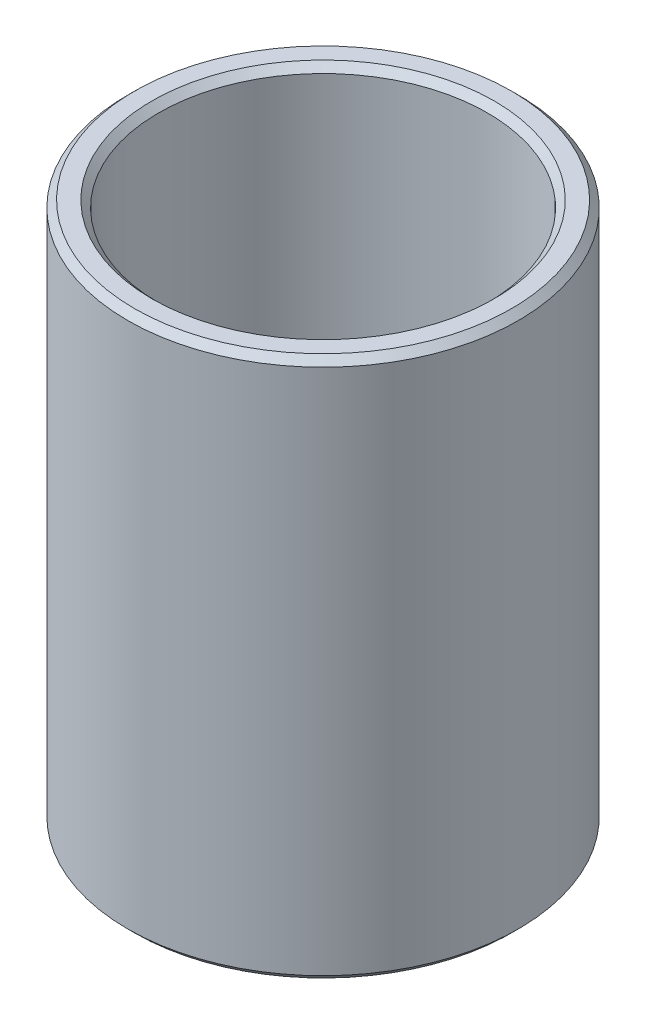
ISO-10303-21;
HEADER;
FILE_DESCRIPTION(('STEP AP214'),'2;1');
FILE_NAME('part.step','',(''),(''),'','','');
FILE_SCHEMA(('AUTOMOTIVE_DESIGN { 1 0 10303 214 1 1 1 1 }'));
ENDSEC;
DATA;
#1=APPLICATION_CONTEXT('core data for automotive mechanical design processes');
#2=APPLICATION_PROTOCOL_DEFINITION('international standard','automotive_design',2000,#1);
#3=PRODUCT_CONTEXT('',#1,'mechanical');
#4=PRODUCT('Part','Part','',(#3));
#5=PRODUCT_RELATED_PRODUCT_CATEGORY('part','',(#4));
#6=PRODUCT_DEFINITION_FORMATION('','',#4);
#7=PRODUCT_DEFINITION_CONTEXT('part definition',#1,'design');
#8=PRODUCT_DEFINITION('design','',#6,#7);
#9=PRODUCT_DEFINITION_SHAPE('','',#8);
#10=(LENGTH_UNIT() NAMED_UNIT(*) SI_UNIT(.MILLI.,.METRE.));
#11=(NAMED_UNIT(*) PLANE_ANGLE_UNIT() SI_UNIT($,.RADIAN.));
#12=(NAMED_UNIT(*) SI_UNIT($,.STERADIAN.) SOLID_ANGLE_UNIT());
#13=UNCERTAINTY_MEASURE_WITH_UNIT(LENGTH_MEASURE(1.E-05),#10,'distance_accuracy_value','');
#14=(GEOMETRIC_REPRESENTATION_CONTEXT(3) GLOBAL_UNCERTAINTY_ASSIGNED_CONTEXT((#13)) GLOBAL_UNIT_ASSIGNED_CONTEXT((#10,
#11,#12)) REPRESENTATION_CONTEXT('',''));
#15=CARTESIAN_POINT('',(0.,0.,0.));
#16=DIRECTION('',(0.,0.,1.));
#17=DIRECTION('',(1.,0.,0.));
#18=AXIS2_PLACEMENT_3D('',#15,#16,#17);
#19=CARTESIAN_POINT('',(0.,103.79687885854,0.));
#20=DIRECTION('',(0.,-1.,0.));
#21=DIRECTION('',(0.,0.,-1.));
#22=AXIS2_PLACEMENT_3D('',#19,#20,#21);
#23=CYLINDRICAL_SURFACE('',#22,37.5);
#24=CARTESIAN_POINT('',(0.,1.31649239230264,0.));
#25=DIRECTION('',(0.,1.,0.));
#26=DIRECTION('',(0.,0.,1.));
#27=AXIS2_PLACEMENT_3D('',#24,#25,#26);
#28=CIRCLE('',#27,37.5);
#29=CARTESIAN_POINT('',(0.,1.31649239230264,37.5));
#30=VERTEX_POINT('',#29);
#31=EDGE_CURVE('E10',#30,#30,#28,.T.);
#32=ORIENTED_EDGE('',*,*,#31,.T.);
#33=EDGE_LOOP('',(#32));
#34=FACE_BOUND('',#33,.T.);
#35=CARTESIAN_POINT('',(0.,102.480386466237,0.));
#36=DIRECTION('',(0.,1.,0.));
#37=DIRECTION('',(0.,0.,1.));
#38=AXIS2_PLACEMENT_3D('',#35,#36,#37);
#39=CIRCLE('',#38,37.5);
#40=CARTESIAN_POINT('',(0.,102.480386466237,37.5));
#41=VERTEX_POINT('',#40);
#42=EDGE_CURVE('E50',#41,#41,#39,.F.);
#43=ORIENTED_EDGE('',*,*,#42,.T.);
#44=EDGE_LOOP('',(#43));
#45=FACE_BOUND('',#44,.T.);
#46=ADVANCED_FACE('F39',(#34,#45),#23,.T.);
#47=CARTESIAN_POINT('',(0.,103.79687885854,0.));
#48=DIRECTION('',(0.,1.,0.));
#49=DIRECTION('',(0.,0.,1.));
#50=AXIS2_PLACEMENT_3D('',#47,#48,#49);
#51=PLANE('',#50);
#52=CARTESIAN_POINT('',(0.,103.79687885854,0.));
#53=DIRECTION('',(0.,1.,0.));
#54=DIRECTION('',(0.,0.,1.));
#55=AXIS2_PLACEMENT_3D('',#52,#53,#54);
#56=CIRCLE('',#55,32.8819684378327);
#57=CARTESIAN_POINT('',(0.,103.79687885854,32.8819684378327));
#58=VERTEX_POINT('',#57);
#59=EDGE_CURVE('E58',#58,#58,#56,.F.);
#60=ORIENTED_EDGE('',*,*,#59,.T.);
#61=EDGE_LOOP('',(#60));
#62=FACE_BOUND('',#61,.T.);
#63=CARTESIAN_POINT('',(0.,103.79687885854,0.));
#64=DIRECTION('',(0.,1.,0.));
#65=DIRECTION('',(0.,0.,1.));
#66=AXIS2_PLACEMENT_3D('',#63,#64,#65);
#67=CIRCLE('',#66,36.1835076076974);
#68=CARTESIAN_POINT('',(0.,103.79687885854,36.1835076076974));
#69=VERTEX_POINT('',#68);
#70=EDGE_CURVE('E61',#69,#69,#67,.T.);
#71=ORIENTED_EDGE('',*,*,#70,.T.);
#72=EDGE_LOOP('',(#71));
#73=FACE_BOUND('',#72,.T.);
#74=ADVANCED_FACE('F88',(#62,#73),#51,.T.);
#75=CARTESIAN_POINT('',(0.,0.,0.));
#76=DIRECTION('',(0.,1.,0.));
#77=DIRECTION('',(0.,0.,1.));
#78=AXIS2_PLACEMENT_3D('',#75,#76,#77);
#79=PLANE('',#78);
#80=CARTESIAN_POINT('',(0.,0.,0.));
#81=DIRECTION('',(0.,1.,0.));
#82=DIRECTION('',(0.,0.,1.));
#83=AXIS2_PLACEMENT_3D('',#80,#81,#82);
#84=CIRCLE('',#83,32.8819684378327);
#85=CARTESIAN_POINT('',(0.,0.,32.8819684378327));
#86=VERTEX_POINT('',#85);
#87=EDGE_CURVE('E51',#86,#86,#84,.T.);
#88=ORIENTED_EDGE('',*,*,#87,.T.);
#89=EDGE_LOOP('',(#88));
#90=FACE_BOUND('',#89,.T.);
#91=CARTESIAN_POINT('',(0.,0.,0.));
#92=DIRECTION('',(0.,1.,0.));
#93=DIRECTION('',(0.,0.,1.));
#94=AXIS2_PLACEMENT_3D('',#91,#92,#93);
#95=CIRCLE('',#94,36.1835076076974);
#96=CARTESIAN_POINT('',(0.,0.,36.1835076076974));
#97=VERTEX_POINT('',#96);
#98=EDGE_CURVE('E54',#97,#97,#95,.F.);
#99=ORIENTED_EDGE('',*,*,#98,.T.);
#100=EDGE_LOOP('',(#99));
#101=FACE_BOUND('',#100,.T.);
#102=ADVANCED_FACE('F83',(#90,#101),#79,.F.);
#103=CARTESIAN_POINT('',(0.,103.79687885854,0.));
#104=DIRECTION('',(0.,-1.,0.));
#105=DIRECTION('',(0.,0.,-1.));
#106=AXIS2_PLACEMENT_3D('',#103,#104,#105);
#107=CYLINDRICAL_SURFACE('',#106,31.56547604553);
#108=CARTESIAN_POINT('',(0.,102.480386466237,0.));
#109=DIRECTION('',(0.,1.,0.));
#110=DIRECTION('',(0.,0.,1.));
#111=AXIS2_PLACEMENT_3D('',#108,#109,#110);
#112=CIRCLE('',#111,31.56547604553);
#113=CARTESIAN_POINT('',(0.,102.480386466237,31.56547604553));
#114=VERTEX_POINT('',#113);
#115=EDGE_CURVE('E67',#114,#114,#112,.T.);
#116=ORIENTED_EDGE('',*,*,#115,.T.);
#117=EDGE_LOOP('',(#116));
#118=FACE_BOUND('',#117,.T.);
#119=CARTESIAN_POINT('',(0.,1.31649239230264,0.));
#120=DIRECTION('',(0.,1.,0.));
#121=DIRECTION('',(0.,0.,1.));
#122=AXIS2_PLACEMENT_3D('',#119,#120,#121);
#123=CIRCLE('',#122,31.56547604553);
#124=CARTESIAN_POINT('',(0.,1.31649239230264,31.56547604553));
#125=VERTEX_POINT('',#124);
#126=EDGE_CURVE('E69',#125,#125,#123,.F.);
#127=ORIENTED_EDGE('',*,*,#126,.T.);
#128=EDGE_LOOP('',(#127));
#129=FACE_BOUND('',#128,.T.);
#130=ADVANCED_FACE('F71',(#118,#129),#107,.F.);
#131=CARTESIAN_POINT('',(0.,102.480386466237,0.));
#132=DIRECTION('',(0.,1.,0.));
#133=DIRECTION('',(0.,0.,1.));
#134=AXIS2_PLACEMENT_3D('',#131,#132,#133);
#135=CONICAL_SURFACE('',#134,31.56547604553,0.785398163397448);
#136=ORIENTED_EDGE('',*,*,#59,.F.);
#137=EDGE_LOOP('',(#136));
#138=FACE_BOUND('',#137,.T.);
#139=ORIENTED_EDGE('',*,*,#115,.F.);
#140=EDGE_LOOP('',(#139));
#141=FACE_BOUND('',#140,.T.);
#142=ADVANCED_FACE('F77',(#138,#141),#135,.F.);
#143=CARTESIAN_POINT('',(0.,0.,0.));
#144=DIRECTION('',(0.,-1.,0.));
#145=DIRECTION('',(0.,0.,-1.));
#146=AXIS2_PLACEMENT_3D('',#143,#144,#145);
#147=CONICAL_SURFACE('',#146,32.8819684378327,0.785398163397443);
#148=ORIENTED_EDGE('',*,*,#126,.F.);
#149=EDGE_LOOP('',(#148));
#150=FACE_BOUND('',#149,.T.);
#151=ORIENTED_EDGE('',*,*,#87,.F.);
#152=EDGE_LOOP('',(#151));
#153=FACE_BOUND('',#152,.T.);
#154=ADVANCED_FACE('F73',(#150,#153),#147,.F.);
#155=CARTESIAN_POINT('',(0.,1.31649239230264,0.));
#156=DIRECTION('',(0.,1.,0.));
#157=DIRECTION('',(0.,0.,1.));
#158=AXIS2_PLACEMENT_3D('',#155,#156,#157);
#159=CONICAL_SURFACE('',#158,37.5,0.785398163397454);
#160=ORIENTED_EDGE('',*,*,#98,.F.);
#161=EDGE_LOOP('',(#160));
#162=FACE_BOUND('',#161,.T.);
#163=ORIENTED_EDGE('',*,*,#31,.F.);
#164=EDGE_LOOP('',(#163));
#165=FACE_BOUND('',#164,.T.);
#166=ADVANCED_FACE('F76',(#162,#165),#159,.T.);
#167=CARTESIAN_POINT('',(0.,103.79687885854,0.));
#168=DIRECTION('',(0.,-1.,0.));
#169=DIRECTION('',(0.,0.,-1.));
#170=AXIS2_PLACEMENT_3D('',#167,#168,#169);
#171=CONICAL_SURFACE('',#170,36.1835076076974,0.785398163397448);
#172=ORIENTED_EDGE('',*,*,#42,.F.);
#173=EDGE_LOOP('',(#172));
#174=FACE_BOUND('',#173,.T.);
#175=ORIENTED_EDGE('',*,*,#70,.F.);
#176=EDGE_LOOP('',(#175));
#177=FACE_BOUND('',#176,.T.);
#178=ADVANCED_FACE('F45',(#174,#177),#171,.T.);
#179=CLOSED_SHELL('',(#46,#74,#102,#130,#142,#154,#166,#178));
#180=MANIFOLD_SOLID_BREP('B2',#179);
#181=ADVANCED_BREP_SHAPE_REPRESENTATION('',(#18,#180),#14);
#182=SHAPE_DEFINITION_REPRESENTATION(#9,#181);
ENDSEC;
END-ISO-10303-21;
